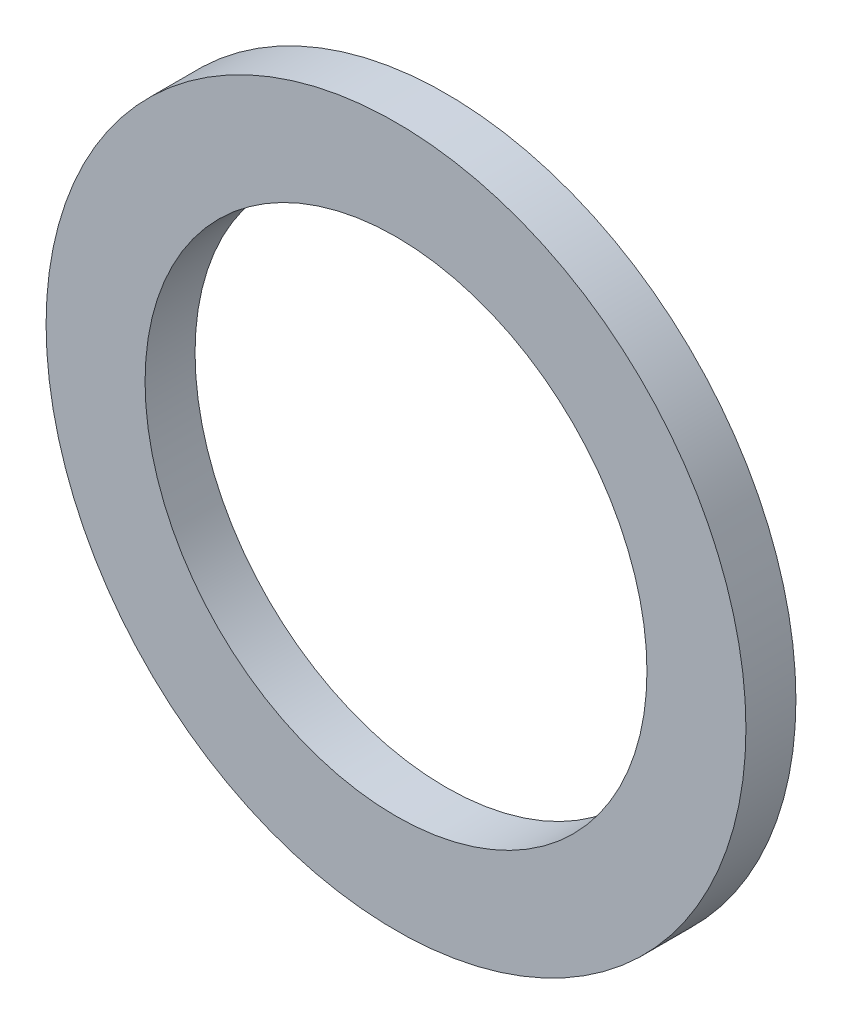
ISO-10303-21;
HEADER;
FILE_DESCRIPTION(('STEP AP214'),'2;1');
FILE_NAME('part.step','',(''),(''),'','','');
FILE_SCHEMA(('AUTOMOTIVE_DESIGN { 1 0 10303 214 1 1 1 1 }'));
ENDSEC;
DATA;
#1=APPLICATION_CONTEXT('core data for automotive mechanical design processes');
#2=APPLICATION_PROTOCOL_DEFINITION('international standard','automotive_design',2000,#1);
#3=PRODUCT_CONTEXT('',#1,'mechanical');
#4=PRODUCT('Part','Part','',(#3));
#5=PRODUCT_RELATED_PRODUCT_CATEGORY('part','',(#4));
#6=PRODUCT_DEFINITION_FORMATION('','',#4);
#7=PRODUCT_DEFINITION_CONTEXT('part definition',#1,'design');
#8=PRODUCT_DEFINITION('design','',#6,#7);
#9=PRODUCT_DEFINITION_SHAPE('','',#8);
#10=(LENGTH_UNIT() NAMED_UNIT(*) SI_UNIT(.MILLI.,.METRE.));
#11=(NAMED_UNIT(*) PLANE_ANGLE_UNIT() SI_UNIT($,.RADIAN.));
#12=(NAMED_UNIT(*) SI_UNIT($,.STERADIAN.) SOLID_ANGLE_UNIT());
#13=UNCERTAINTY_MEASURE_WITH_UNIT(LENGTH_MEASURE(1.E-05),#10,'distance_accuracy_value','');
#14=(GEOMETRIC_REPRESENTATION_CONTEXT(3) GLOBAL_UNCERTAINTY_ASSIGNED_CONTEXT((#13)) GLOBAL_UNIT_ASSIGNED_CONTEXT((#10,
#11,#12)) REPRESENTATION_CONTEXT('',''));
#15=CARTESIAN_POINT('',(0.,0.,0.));
#16=DIRECTION('',(0.,0.,1.));
#17=DIRECTION('',(1.,0.,0.));
#18=AXIS2_PLACEMENT_3D('',#15,#16,#17);
#19=CARTESIAN_POINT('',(0.,0.,3.175));
#20=DIRECTION('',(0.,0.,1.));
#21=DIRECTION('',(1.,0.,0.));
#22=AXIS2_PLACEMENT_3D('',#19,#20,#21);
#23=PLANE('',#22);
#24=CARTESIAN_POINT('',(0.,0.,3.175));
#25=DIRECTION('',(0.,0.,1.));
#26=DIRECTION('',(1.,0.,0.));
#27=AXIS2_PLACEMENT_3D('',#24,#25,#26);
#28=CIRCLE('',#27,22.225);
#29=CARTESIAN_POINT('',(22.225,0.,3.175));
#30=VERTEX_POINT('',#29);
#31=EDGE_CURVE('E10',#30,#30,#28,.T.);
#32=ORIENTED_EDGE('',*,*,#31,.T.);
#33=EDGE_LOOP('',(#32));
#34=FACE_BOUND('',#33,.T.);
#35=CARTESIAN_POINT('',(0.,0.,3.175));
#36=DIRECTION('',(0.,0.,1.));
#37=DIRECTION('',(1.,0.,0.));
#38=AXIS2_PLACEMENT_3D('',#35,#36,#37);
#39=CIRCLE('',#38,15.9385);
#40=CARTESIAN_POINT('',(15.9385,0.,3.175));
#41=VERTEX_POINT('',#40);
#42=EDGE_CURVE('E41',#41,#41,#39,.T.);
#43=ORIENTED_EDGE('',*,*,#42,.F.);
#44=EDGE_LOOP('',(#43));
#45=FACE_BOUND('',#44,.T.);
#46=ADVANCED_FACE('F30',(#34,#45),#23,.T.);
#47=CARTESIAN_POINT('',(0.,0.,0.));
#48=DIRECTION('',(0.,0.,1.));
#49=DIRECTION('',(1.,0.,0.));
#50=AXIS2_PLACEMENT_3D('',#47,#48,#49);
#51=PLANE('',#50);
#52=CARTESIAN_POINT('',(0.,0.,0.));
#53=DIRECTION('',(0.,0.,1.));
#54=DIRECTION('',(1.,0.,0.));
#55=AXIS2_PLACEMENT_3D('',#52,#53,#54);
#56=CIRCLE('',#55,22.225);
#57=CARTESIAN_POINT('',(22.225,0.,0.));
#58=VERTEX_POINT('',#57);
#59=EDGE_CURVE('E34',#58,#58,#56,.T.);
#60=ORIENTED_EDGE('',*,*,#59,.F.);
#61=EDGE_LOOP('',(#60));
#62=FACE_BOUND('',#61,.T.);
#63=CARTESIAN_POINT('',(0.,0.,0.));
#64=DIRECTION('',(0.,0.,1.));
#65=DIRECTION('',(1.,0.,0.));
#66=AXIS2_PLACEMENT_3D('',#63,#64,#65);
#67=CIRCLE('',#66,15.9385);
#68=CARTESIAN_POINT('',(15.9385,0.,0.));
#69=VERTEX_POINT('',#68);
#70=EDGE_CURVE('E43',#69,#69,#67,.T.);
#71=ORIENTED_EDGE('',*,*,#70,.T.);
#72=EDGE_LOOP('',(#71));
#73=FACE_BOUND('',#72,.T.);
#74=ADVANCED_FACE('F53',(#62,#73),#51,.F.);
#75=CARTESIAN_POINT('',(0.,0.,3.175));
#76=DIRECTION('',(0.,0.,-1.));
#77=DIRECTION('',(-1.,0.,0.));
#78=AXIS2_PLACEMENT_3D('',#75,#76,#77);
#79=CYLINDRICAL_SURFACE('',#78,22.225);
#80=ORIENTED_EDGE('',*,*,#31,.F.);
#81=EDGE_LOOP('',(#80));
#82=FACE_BOUND('',#81,.T.);
#83=ORIENTED_EDGE('',*,*,#59,.T.);
#84=EDGE_LOOP('',(#83));
#85=FACE_BOUND('',#84,.T.);
#86=ADVANCED_FACE('F32',(#82,#85),#79,.T.);
#87=CARTESIAN_POINT('',(0.,0.,3.175));
#88=DIRECTION('',(0.,0.,-1.));
#89=DIRECTION('',(-1.,0.,0.));
#90=AXIS2_PLACEMENT_3D('',#87,#88,#89);
#91=CYLINDRICAL_SURFACE('',#90,15.9385);
#92=ORIENTED_EDGE('',*,*,#42,.T.);
#93=EDGE_LOOP('',(#92));
#94=FACE_BOUND('',#93,.T.);
#95=ORIENTED_EDGE('',*,*,#70,.F.);
#96=EDGE_LOOP('',(#95));
#97=FACE_BOUND('',#96,.T.);
#98=ADVANCED_FACE('F49',(#94,#97),#91,.F.);
#99=CLOSED_SHELL('',(#46,#74,#86,#98));
#100=MANIFOLD_SOLID_BREP('B2',#99);
#101=ADVANCED_BREP_SHAPE_REPRESENTATION('',(#18,#100),#14);
#102=SHAPE_DEFINITION_REPRESENTATION(#9,#101);
ENDSEC;
END-ISO-10303-21;
